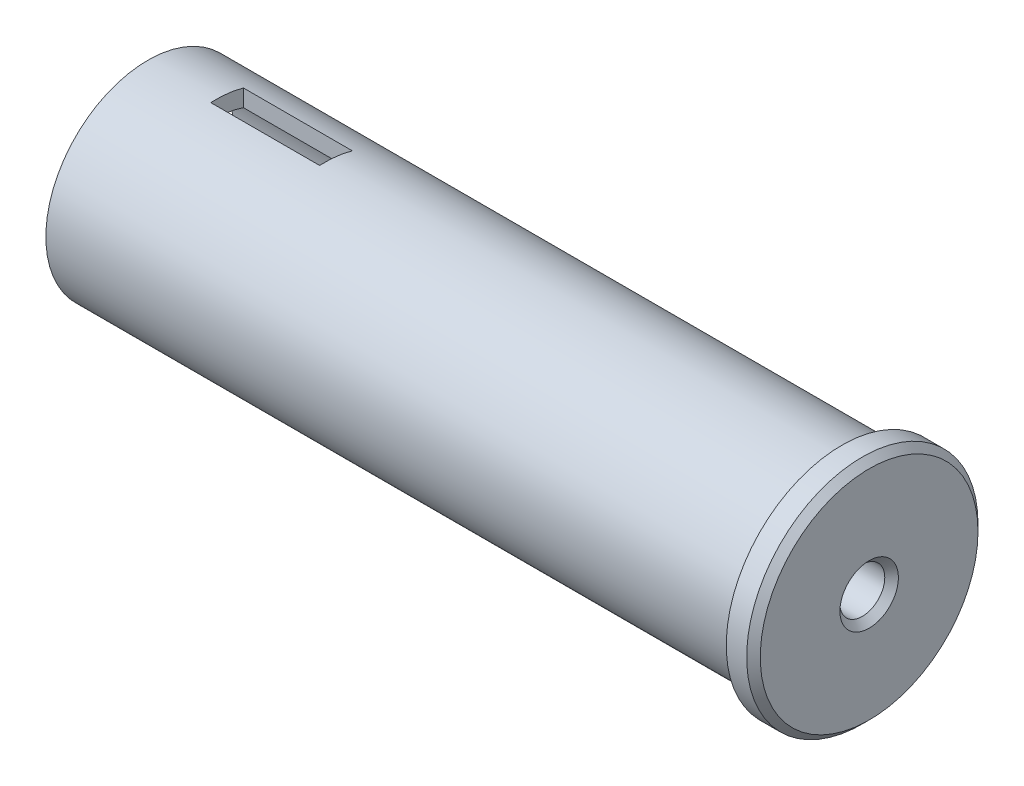
ISO-10303-21;
HEADER;
FILE_DESCRIPTION(('STEP AP214'),'2;1');
FILE_NAME('part.step','',(''),(''),'','','');
FILE_SCHEMA(('AUTOMOTIVE_DESIGN { 1 0 10303 214 1 1 1 1 }'));
ENDSEC;
DATA;
#1=APPLICATION_CONTEXT('core data for automotive mechanical design processes');
#2=APPLICATION_PROTOCOL_DEFINITION('international standard','automotive_design',2000,#1);
#3=PRODUCT_CONTEXT('',#1,'mechanical');
#4=PRODUCT('Part','Part','',(#3));
#5=PRODUCT_RELATED_PRODUCT_CATEGORY('part','',(#4));
#6=PRODUCT_DEFINITION_FORMATION('','',#4);
#7=PRODUCT_DEFINITION_CONTEXT('part definition',#1,'design');
#8=PRODUCT_DEFINITION('design','',#6,#7);
#9=PRODUCT_DEFINITION_SHAPE('','',#8);
#10=(LENGTH_UNIT() NAMED_UNIT(*) SI_UNIT(.MILLI.,.METRE.));
#11=(NAMED_UNIT(*) PLANE_ANGLE_UNIT() SI_UNIT($,.RADIAN.));
#12=(NAMED_UNIT(*) SI_UNIT($,.STERADIAN.) SOLID_ANGLE_UNIT());
#13=UNCERTAINTY_MEASURE_WITH_UNIT(LENGTH_MEASURE(1.E-05),#10,'distance_accuracy_value','');
#14=(GEOMETRIC_REPRESENTATION_CONTEXT(3) GLOBAL_UNCERTAINTY_ASSIGNED_CONTEXT((#13)) GLOBAL_UNIT_ASSIGNED_CONTEXT((#10,
#11,#12)) REPRESENTATION_CONTEXT('',''));
#15=CARTESIAN_POINT('',(0.,0.,0.));
#16=DIRECTION('',(0.,0.,1.));
#17=DIRECTION('',(1.,0.,0.));
#18=AXIS2_PLACEMENT_3D('',#15,#16,#17);
#19=CARTESIAN_POINT('',(0.,0.,-8.50000000000001));
#20=DIRECTION('',(1.,0.,0.));
#21=DIRECTION('',(0.,0.,-1.));
#22=AXIS2_PLACEMENT_3D('',#19,#20,#21);
#23=PLANE('',#22);
#24=CARTESIAN_POINT('',(0.,0.,0.));
#25=DIRECTION('',(1.,0.,0.));
#26=DIRECTION('',(0.,0.,-1.));
#27=AXIS2_PLACEMENT_3D('',#24,#25,#26);
#28=CIRCLE('',#27,2.15);
#29=CARTESIAN_POINT('',(0.,0.,-2.15));
#30=VERTEX_POINT('',#29);
#31=EDGE_CURVE('E154',#30,#30,#28,.F.);
#32=ORIENTED_EDGE('',*,*,#31,.T.);
#33=EDGE_LOOP('',(#32));
#34=FACE_BOUND('',#33,.T.);
#35=CARTESIAN_POINT('',(0.,0.,0.));
#36=DIRECTION('',(1.,0.,0.));
#37=DIRECTION('',(0.,0.,-1.));
#38=AXIS2_PLACEMENT_3D('',#35,#36,#37);
#39=CIRCLE('',#38,8.00000000000001);
#40=CARTESIAN_POINT('',(0.,0.,-8.00000000000001));
#41=VERTEX_POINT('',#40);
#42=EDGE_CURVE('E151',#41,#41,#39,.T.);
#43=ORIENTED_EDGE('',*,*,#42,.T.);
#44=EDGE_LOOP('',(#43));
#45=FACE_BOUND('',#44,.T.);
#46=ADVANCED_FACE('F32',(#34,#45),#23,.T.);
#47=CARTESIAN_POINT('',(0.,0.,0.));
#48=DIRECTION('',(1.,0.,0.));
#49=DIRECTION('',(0.,0.,-1.));
#50=AXIS2_PLACEMENT_3D('',#47,#48,#49);
#51=CYLINDRICAL_SURFACE('',#50,1.65);
#52=CARTESIAN_POINT('',(-0.500000000000004,0.,0.));
#53=DIRECTION('',(1.,0.,0.));
#54=DIRECTION('',(0.,0.,-1.));
#55=AXIS2_PLACEMENT_3D('',#52,#53,#54);
#56=CIRCLE('',#55,1.65);
#57=CARTESIAN_POINT('',(-0.500000000000004,0.,-1.65));
#58=VERTEX_POINT('',#57);
#59=EDGE_CURVE('E148',#58,#58,#56,.T.);
#60=ORIENTED_EDGE('',*,*,#59,.T.);
#61=EDGE_LOOP('',(#60));
#62=FACE_BOUND('',#61,.T.);
#63=CARTESIAN_POINT('',(-11.,0.,0.));
#64=DIRECTION('',(1.,0.,0.));
#65=DIRECTION('',(0.,0.,-1.));
#66=AXIS2_PLACEMENT_3D('',#63,#64,#65);
#67=CIRCLE('',#66,1.65);
#68=CARTESIAN_POINT('',(-11.,0.,-1.65));
#69=VERTEX_POINT('',#68);
#70=EDGE_CURVE('E145',#69,#69,#67,.T.);
#71=ORIENTED_EDGE('',*,*,#70,.F.);
#72=EDGE_LOOP('',(#71));
#73=FACE_BOUND('',#72,.T.);
#74=ADVANCED_FACE('F217',(#62,#73),#51,.F.);
#75=CARTESIAN_POINT('',(-11.,0.,-1.65));
#76=DIRECTION('',(-1.,0.,0.));
#77=DIRECTION('',(0.,0.,1.));
#78=AXIS2_PLACEMENT_3D('',#75,#76,#77);
#79=PLANE('',#78);
#80=ORIENTED_EDGE('',*,*,#70,.T.);
#81=EDGE_LOOP('',(#80));
#82=FACE_BOUND('',#81,.T.);
#83=CARTESIAN_POINT('',(-11.,0.,0.));
#84=DIRECTION('',(1.,0.,0.));
#85=DIRECTION('',(0.,0.,-1.));
#86=AXIS2_PLACEMENT_3D('',#83,#84,#85);
#87=CIRCLE('',#86,6.30000000000001);
#88=CARTESIAN_POINT('',(-11.,0.,-6.30000000000001));
#89=VERTEX_POINT('',#88);
#90=EDGE_CURVE('E142',#89,#89,#87,.T.);
#91=ORIENTED_EDGE('',*,*,#90,.F.);
#92=EDGE_LOOP('',(#91));
#93=FACE_BOUND('',#92,.T.);
#94=ADVANCED_FACE('F223',(#82,#93),#79,.T.);
#95=CARTESIAN_POINT('',(0.,0.,0.));
#96=DIRECTION('',(1.,0.,0.));
#97=DIRECTION('',(0.,0.,-1.));
#98=AXIS2_PLACEMENT_3D('',#95,#96,#97);
#99=CYLINDRICAL_SURFACE('',#98,6.30000000000001);
#100=CARTESIAN_POINT('',(-48.,0.,0.));
#101=DIRECTION('',(-1.,0.,0.));
#102=DIRECTION('',(0.,0.,1.));
#103=AXIS2_PLACEMENT_3D('',#100,#101,#102);
#104=CIRCLE('',#103,6.30000000000001);
#105=CARTESIAN_POINT('',(-48.,-5.96837058150195,-2.0170653439743));
#106=VERTEX_POINT('',#105);
#107=CARTESIAN_POINT('',(-48.,-6.28835121865935,0.382934656025704));
#108=VERTEX_POINT('',#107);
#109=EDGE_CURVE('E127',#106,#108,#104,.T.);
#110=ORIENTED_EDGE('',*,*,#109,.F.);
#111=DIRECTION('',(1.,0.,0.));
#112=VECTOR('',#111,1.);
#113=CARTESIAN_POINT('',(0.,-5.96837058150195,-2.0170653439743));
#114=LINE('',#113,#112);
#115=CARTESIAN_POINT('',(-40.,-5.96837058150195,-2.0170653439743));
#116=VERTEX_POINT('',#115);
#117=EDGE_CURVE('E119',#116,#106,#114,.F.);
#118=ORIENTED_EDGE('',*,*,#117,.F.);
#119=CARTESIAN_POINT('',(-40.,0.,0.));
#120=DIRECTION('',(1.,0.,0.));
#121=DIRECTION('',(0.,0.,-1.));
#122=AXIS2_PLACEMENT_3D('',#119,#120,#121);
#123=CIRCLE('',#122,6.30000000000001);
#124=CARTESIAN_POINT('',(-40.,-6.28835121865935,0.382934656025703));
#125=VERTEX_POINT('',#124);
#126=EDGE_CURVE('E104',#125,#116,#123,.T.);
#127=ORIENTED_EDGE('',*,*,#126,.F.);
#128=DIRECTION('',(1.,0.,0.));
#129=VECTOR('',#128,1.);
#130=CARTESIAN_POINT('',(0.,-6.28835121865935,0.382934656025698));
#131=LINE('',#130,#129);
#132=EDGE_CURVE('E96',#108,#125,#131,.T.);
#133=ORIENTED_EDGE('',*,*,#132,.F.);
#134=EDGE_LOOP('',(#110,#118,#127,#133));
#135=FACE_BOUND('',#134,.T.);
#136=CARTESIAN_POINT('',(-48.,6.28835121865935,0.382934656025704));
#137=VERTEX_POINT('',#136);
#138=CARTESIAN_POINT('',(-48.,5.96837058150195,-2.0170653439743));
#139=VERTEX_POINT('',#138);
#140=EDGE_CURVE('E129',#137,#139,#104,.T.);
#141=ORIENTED_EDGE('',*,*,#140,.F.);
#142=DIRECTION('',(1.,0.,0.));
#143=VECTOR('',#142,1.);
#144=CARTESIAN_POINT('',(0.,6.28835121865935,0.382934656025698));
#145=LINE('',#144,#143);
#146=CARTESIAN_POINT('',(-40.,6.28835121865935,0.382934656025703));
#147=VERTEX_POINT('',#146);
#148=EDGE_CURVE('E105',#147,#137,#145,.F.);
#149=ORIENTED_EDGE('',*,*,#148,.F.);
#150=CARTESIAN_POINT('',(-40.,5.96837058150195,-2.0170653439743));
#151=VERTEX_POINT('',#150);
#152=EDGE_CURVE('E120',#151,#147,#123,.T.);
#153=ORIENTED_EDGE('',*,*,#152,.F.);
#154=DIRECTION('',(1.,0.,0.));
#155=VECTOR('',#154,1.);
#156=CARTESIAN_POINT('',(0.,5.96837058150195,-2.0170653439743));
#157=LINE('',#156,#155);
#158=EDGE_CURVE('E125',#139,#151,#157,.T.);
#159=ORIENTED_EDGE('',*,*,#158,.F.);
#160=EDGE_LOOP('',(#141,#149,#153,#159));
#161=FACE_BOUND('',#160,.T.);
#162=ORIENTED_EDGE('',*,*,#90,.T.);
#163=EDGE_LOOP('',(#162));
#164=FACE_BOUND('',#163,.T.);
#165=CARTESIAN_POINT('',(-53.,0.,0.));
#166=DIRECTION('',(1.,0.,0.));
#167=DIRECTION('',(0.,0.,-1.));
#168=AXIS2_PLACEMENT_3D('',#165,#166,#167);
#169=CIRCLE('',#168,6.3);
#170=CARTESIAN_POINT('',(-53.,0.,-6.3));
#171=VERTEX_POINT('',#170);
#172=EDGE_CURVE('E139',#171,#171,#169,.T.);
#173=ORIENTED_EDGE('',*,*,#172,.F.);
#174=EDGE_LOOP('',(#173));
#175=FACE_BOUND('',#174,.T.);
#176=ADVANCED_FACE('F117',(#135,#161,#164,#175),#99,.F.);
#177=CARTESIAN_POINT('',(-53.,0.,-7.50000000000001));
#178=DIRECTION('',(-1.,0.,0.));
#179=DIRECTION('',(0.,0.,1.));
#180=AXIS2_PLACEMENT_3D('',#177,#178,#179);
#181=PLANE('',#180);
#182=ORIENTED_EDGE('',*,*,#172,.T.);
#183=EDGE_LOOP('',(#182));
#184=FACE_BOUND('',#183,.T.);
#185=CARTESIAN_POINT('',(-53.,0.,0.));
#186=DIRECTION('',(1.,0.,0.));
#187=DIRECTION('',(0.,0.,-1.));
#188=AXIS2_PLACEMENT_3D('',#185,#186,#187);
#189=CIRCLE('',#188,7.50000000000002);
#190=CARTESIAN_POINT('',(-53.,0.,-7.50000000000001));
#191=VERTEX_POINT('',#190);
#192=EDGE_CURVE('E136',#191,#191,#189,.T.);
#193=ORIENTED_EDGE('',*,*,#192,.F.);
#194=EDGE_LOOP('',(#193));
#195=FACE_BOUND('',#194,.T.);
#196=ADVANCED_FACE('F251',(#184,#195),#181,.T.);
#197=CARTESIAN_POINT('',(0.,0.,0.));
#198=DIRECTION('',(1.,0.,0.));
#199=DIRECTION('',(0.,0.,-1.));
#200=AXIS2_PLACEMENT_3D('',#197,#198,#199);
#201=CYLINDRICAL_SURFACE('',#200,7.50000000000001);
#202=CARTESIAN_POINT('',(-48.,0.,0.));
#203=DIRECTION('',(-1.,0.,0.));
#204=DIRECTION('',(0.,0.,1.));
#205=AXIS2_PLACEMENT_3D('',#202,#203,#204);
#206=CIRCLE('',#205,7.50000000000001);
#207=CARTESIAN_POINT('',(-48.,-7.49021769037553,0.382934656025704));
#208=VERTEX_POINT('',#207);
#209=CARTESIAN_POINT('',(-48.,-7.2236727084038,-2.0170653439743));
#210=VERTEX_POINT('',#209);
#211=EDGE_CURVE('E11',#208,#210,#206,.F.);
#212=ORIENTED_EDGE('',*,*,#211,.F.);
#213=DIRECTION('',(1.,0.,0.));
#214=VECTOR('',#213,1.);
#215=CARTESIAN_POINT('',(0.,-7.49021769037553,0.382934656025698));
#216=LINE('',#215,#214);
#217=CARTESIAN_POINT('',(-40.,-7.49021769037553,0.382934656025703));
#218=VERTEX_POINT('',#217);
#219=EDGE_CURVE('E166',#218,#208,#216,.F.);
#220=ORIENTED_EDGE('',*,*,#219,.F.);
#221=CARTESIAN_POINT('',(-40.,0.,0.));
#222=DIRECTION('',(1.,0.,0.));
#223=DIRECTION('',(0.,0.,-1.));
#224=AXIS2_PLACEMENT_3D('',#221,#222,#223);
#225=CIRCLE('',#224,7.50000000000001);
#226=CARTESIAN_POINT('',(-40.,-7.2236727084038,-2.0170653439743));
#227=VERTEX_POINT('',#226);
#228=EDGE_CURVE('E112',#227,#218,#225,.F.);
#229=ORIENTED_EDGE('',*,*,#228,.F.);
#230=DIRECTION('',(1.,0.,0.));
#231=VECTOR('',#230,1.);
#232=CARTESIAN_POINT('',(0.,-7.2236727084038,-2.0170653439743));
#233=LINE('',#232,#231);
#234=EDGE_CURVE('E36',#210,#227,#233,.T.);
#235=ORIENTED_EDGE('',*,*,#234,.F.);
#236=EDGE_LOOP('',(#212,#220,#229,#235));
#237=FACE_BOUND('',#236,.T.);
#238=CARTESIAN_POINT('',(-48.,7.2236727084038,-2.0170653439743));
#239=VERTEX_POINT('',#238);
#240=CARTESIAN_POINT('',(-48.,7.49021769037553,0.382934656025704));
#241=VERTEX_POINT('',#240);
#242=EDGE_CURVE('E42',#239,#241,#206,.F.);
#243=ORIENTED_EDGE('',*,*,#242,.F.);
#244=DIRECTION('',(1.,0.,0.));
#245=VECTOR('',#244,1.);
#246=CARTESIAN_POINT('',(0.,7.2236727084038,-2.0170653439743));
#247=LINE('',#246,#245);
#248=CARTESIAN_POINT('',(-40.,7.2236727084038,-2.0170653439743));
#249=VERTEX_POINT('',#248);
#250=EDGE_CURVE('E164',#249,#239,#247,.F.);
#251=ORIENTED_EDGE('',*,*,#250,.F.);
#252=CARTESIAN_POINT('',(-40.,7.49021769037553,0.382934656025703));
#253=VERTEX_POINT('',#252);
#254=EDGE_CURVE('E162',#253,#249,#225,.F.);
#255=ORIENTED_EDGE('',*,*,#254,.F.);
#256=DIRECTION('',(1.,0.,0.));
#257=VECTOR('',#256,1.);
#258=CARTESIAN_POINT('',(0.,7.49021769037553,0.382934656025698));
#259=LINE('',#258,#257);
#260=EDGE_CURVE('E160',#241,#253,#259,.T.);
#261=ORIENTED_EDGE('',*,*,#260,.F.);
#262=EDGE_LOOP('',(#243,#251,#255,#261));
#263=FACE_BOUND('',#262,.T.);
#264=ORIENTED_EDGE('',*,*,#192,.T.);
#265=EDGE_LOOP('',(#264));
#266=FACE_BOUND('',#265,.T.);
#267=CARTESIAN_POINT('',(-2.,0.,0.));
#268=DIRECTION('',(1.,0.,0.));
#269=DIRECTION('',(0.,0.,-1.));
#270=AXIS2_PLACEMENT_3D('',#267,#268,#269);
#271=CIRCLE('',#270,7.5);
#272=CARTESIAN_POINT('',(-2.,0.,-7.5));
#273=VERTEX_POINT('',#272);
#274=EDGE_CURVE('E133',#273,#273,#271,.T.);
#275=ORIENTED_EDGE('',*,*,#274,.F.);
#276=EDGE_LOOP('',(#275));
#277=FACE_BOUND('',#276,.T.);
#278=ADVANCED_FACE('F178',(#237,#263,#266,#277),#201,.T.);
#279=CARTESIAN_POINT('',(-2.,0.,-7.5));
#280=DIRECTION('',(-1.,0.,0.));
#281=DIRECTION('',(0.,0.,1.));
#282=AXIS2_PLACEMENT_3D('',#279,#280,#281);
#283=PLANE('',#282);
#284=ORIENTED_EDGE('',*,*,#274,.T.);
#285=EDGE_LOOP('',(#284));
#286=FACE_BOUND('',#285,.T.);
#287=CARTESIAN_POINT('',(-2.,0.,0.));
#288=DIRECTION('',(1.,0.,0.));
#289=DIRECTION('',(0.,0.,-1.));
#290=AXIS2_PLACEMENT_3D('',#287,#288,#289);
#291=CIRCLE('',#290,8.5);
#292=CARTESIAN_POINT('',(-2.,0.,-8.5));
#293=VERTEX_POINT('',#292);
#294=EDGE_CURVE('E130',#293,#293,#291,.T.);
#295=ORIENTED_EDGE('',*,*,#294,.F.);
#296=EDGE_LOOP('',(#295));
#297=FACE_BOUND('',#296,.T.);
#298=ADVANCED_FACE('F237',(#286,#297),#283,.T.);
#299=CARTESIAN_POINT('',(0.,0.,0.));
#300=DIRECTION('',(1.,0.,0.));
#301=DIRECTION('',(0.,0.,-1.));
#302=AXIS2_PLACEMENT_3D('',#299,#300,#301);
#303=CYLINDRICAL_SURFACE('',#302,8.5);
#304=CARTESIAN_POINT('',(-0.499999999999991,0.,0.));
#305=DIRECTION('',(1.,0.,0.));
#306=DIRECTION('',(0.,0.,-1.));
#307=AXIS2_PLACEMENT_3D('',#304,#305,#306);
#308=CIRCLE('',#307,8.5);
#309=CARTESIAN_POINT('',(-0.499999999999992,0.,-8.5));
#310=VERTEX_POINT('',#309);
#311=EDGE_CURVE('E157',#310,#310,#308,.F.);
#312=ORIENTED_EDGE('',*,*,#311,.T.);
#313=EDGE_LOOP('',(#312));
#314=FACE_BOUND('',#313,.T.);
#315=ORIENTED_EDGE('',*,*,#294,.T.);
#316=EDGE_LOOP('',(#315));
#317=FACE_BOUND('',#316,.T.);
#318=ADVANCED_FACE('F230',(#314,#317),#303,.T.);
#319=CARTESIAN_POINT('',(-0.500000000000004,0.,0.));
#320=DIRECTION('',(1.,0.,0.));
#321=DIRECTION('',(0.,0.,-1.));
#322=AXIS2_PLACEMENT_3D('',#319,#320,#321);
#323=CONICAL_SURFACE('',#322,1.65,0.785398163397443);
#324=ORIENTED_EDGE('',*,*,#31,.F.);
#325=EDGE_LOOP('',(#324));
#326=FACE_BOUND('',#325,.T.);
#327=ORIENTED_EDGE('',*,*,#59,.F.);
#328=EDGE_LOOP('',(#327));
#329=FACE_BOUND('',#328,.T.);
#330=ADVANCED_FACE('F228',(#326,#329),#323,.F.);
#331=CARTESIAN_POINT('',(0.,0.,0.));
#332=DIRECTION('',(-1.,0.,0.));
#333=DIRECTION('',(0.,0.,1.));
#334=AXIS2_PLACEMENT_3D('',#331,#332,#333);
#335=CONICAL_SURFACE('',#334,8.00000000000001,0.785398163397454);
#336=ORIENTED_EDGE('',*,*,#311,.F.);
#337=EDGE_LOOP('',(#336));
#338=FACE_BOUND('',#337,.T.);
#339=ORIENTED_EDGE('',*,*,#42,.F.);
#340=EDGE_LOOP('',(#339));
#341=FACE_BOUND('',#340,.T.);
#342=ADVANCED_FACE('F34',(#338,#341),#335,.T.);
#343=CARTESIAN_POINT('',(-40.,-8.5,0.382934656025703));
#344=DIRECTION('',(0.,0.,1.));
#345=DIRECTION('',(1.,0.,0.));
#346=AXIS2_PLACEMENT_3D('',#343,#344,#345);
#347=PLANE('',#346);
#348=ORIENTED_EDGE('',*,*,#148,.T.);
#349=DIRECTION('',(0.,1.,0.));
#350=VECTOR('',#349,1.);
#351=CARTESIAN_POINT('',(-48.,-8.5,0.382934656025704));
#352=LINE('',#351,#350);
#353=EDGE_CURVE('E182',#137,#241,#352,.T.);
#354=ORIENTED_EDGE('',*,*,#353,.T.);
#355=ORIENTED_EDGE('',*,*,#260,.T.);
#356=DIRECTION('',(0.,1.,0.));
#357=VECTOR('',#356,1.);
#358=CARTESIAN_POINT('',(-40.,-8.5,0.382934656025703));
#359=LINE('',#358,#357);
#360=EDGE_CURVE('E57',#147,#253,#359,.T.);
#361=ORIENTED_EDGE('',*,*,#360,.F.);
#362=EDGE_LOOP('',(#348,#354,#355,#361));
#363=FACE_BOUND('',#362,.T.);
#364=ADVANCED_FACE('F207',(#363),#347,.F.);
#365=CARTESIAN_POINT('',(-40.,-8.5,-2.0170653439743));
#366=DIRECTION('',(1.,0.,0.));
#367=DIRECTION('',(0.,0.,-1.));
#368=AXIS2_PLACEMENT_3D('',#365,#366,#367);
#369=PLANE('',#368);
#370=ORIENTED_EDGE('',*,*,#152,.T.);
#371=ORIENTED_EDGE('',*,*,#360,.T.);
#372=ORIENTED_EDGE('',*,*,#254,.T.);
#373=DIRECTION('',(0.,1.,0.));
#374=VECTOR('',#373,1.);
#375=CARTESIAN_POINT('',(-40.,-8.5,-2.0170653439743));
#376=LINE('',#375,#374);
#377=EDGE_CURVE('E114',#151,#249,#376,.T.);
#378=ORIENTED_EDGE('',*,*,#377,.F.);
#379=EDGE_LOOP('',(#370,#371,#372,#378));
#380=FACE_BOUND('',#379,.T.);
#381=ADVANCED_FACE('F205',(#380),#369,.F.);
#382=CARTESIAN_POINT('',(-40.,-8.5,-2.0170653439743));
#383=DIRECTION('',(0.,0.,-1.));
#384=DIRECTION('',(-1.,0.,0.));
#385=AXIS2_PLACEMENT_3D('',#382,#383,#384);
#386=PLANE('',#385);
#387=ORIENTED_EDGE('',*,*,#158,.T.);
#388=ORIENTED_EDGE('',*,*,#377,.T.);
#389=ORIENTED_EDGE('',*,*,#250,.T.);
#390=DIRECTION('',(0.,1.,0.));
#391=VECTOR('',#390,1.);
#392=CARTESIAN_POINT('',(-48.,-8.5,-2.0170653439743));
#393=LINE('',#392,#391);
#394=EDGE_CURVE('E176',#139,#239,#393,.T.);
#395=ORIENTED_EDGE('',*,*,#394,.F.);
#396=EDGE_LOOP('',(#387,#388,#389,#395));
#397=FACE_BOUND('',#396,.T.);
#398=ADVANCED_FACE('F192',(#397),#386,.F.);
#399=CARTESIAN_POINT('',(-48.,-8.5,-2.0170653439743));
#400=DIRECTION('',(-1.,0.,0.));
#401=DIRECTION('',(0.,0.,1.));
#402=AXIS2_PLACEMENT_3D('',#399,#400,#401);
#403=PLANE('',#402);
#404=ORIENTED_EDGE('',*,*,#140,.T.);
#405=ORIENTED_EDGE('',*,*,#394,.T.);
#406=ORIENTED_EDGE('',*,*,#242,.T.);
#407=ORIENTED_EDGE('',*,*,#353,.F.);
#408=EDGE_LOOP('',(#404,#405,#406,#407));
#409=FACE_BOUND('',#408,.T.);
#410=ADVANCED_FACE('F202',(#409),#403,.F.);
#411=ORIENTED_EDGE('',*,*,#132,.T.);
#412=EDGE_CURVE('E99',#218,#125,#359,.T.);
#413=ORIENTED_EDGE('',*,*,#412,.F.);
#414=ORIENTED_EDGE('',*,*,#219,.T.);
#415=EDGE_CURVE('E49',#208,#108,#352,.T.);
#416=ORIENTED_EDGE('',*,*,#415,.T.);
#417=EDGE_LOOP('',(#411,#413,#414,#416));
#418=FACE_BOUND('',#417,.T.);
#419=ADVANCED_FACE('F98',(#418),#347,.F.);
#420=ORIENTED_EDGE('',*,*,#109,.T.);
#421=ORIENTED_EDGE('',*,*,#415,.F.);
#422=ORIENTED_EDGE('',*,*,#211,.T.);
#423=EDGE_CURVE('E173',#210,#106,#393,.T.);
#424=ORIENTED_EDGE('',*,*,#423,.T.);
#425=EDGE_LOOP('',(#420,#421,#422,#424));
#426=FACE_BOUND('',#425,.T.);
#427=ADVANCED_FACE('F181',(#426),#403,.F.);
#428=ORIENTED_EDGE('',*,*,#117,.T.);
#429=ORIENTED_EDGE('',*,*,#423,.F.);
#430=ORIENTED_EDGE('',*,*,#234,.T.);
#431=EDGE_CURVE('E171',#227,#116,#376,.T.);
#432=ORIENTED_EDGE('',*,*,#431,.T.);
#433=EDGE_LOOP('',(#428,#429,#430,#432));
#434=FACE_BOUND('',#433,.T.);
#435=ADVANCED_FACE('F170',(#434),#386,.F.);
#436=ORIENTED_EDGE('',*,*,#126,.T.);
#437=ORIENTED_EDGE('',*,*,#431,.F.);
#438=ORIENTED_EDGE('',*,*,#228,.T.);
#439=ORIENTED_EDGE('',*,*,#412,.T.);
#440=EDGE_LOOP('',(#436,#437,#438,#439));
#441=FACE_BOUND('',#440,.T.);
#442=ADVANCED_FACE('F108',(#441),#369,.F.);
#443=CLOSED_SHELL('',(#46,#74,#94,#176,#196,#278,#298,#318,#330,#342,#364,#381,#398,#410,#419,
#427,#435,#442));
#444=MANIFOLD_SOLID_BREP('B2',#443);
#445=ADVANCED_BREP_SHAPE_REPRESENTATION('',(#18,#444),#14);
#446=SHAPE_DEFINITION_REPRESENTATION(#9,#445);
ENDSEC;
END-ISO-10303-21;
